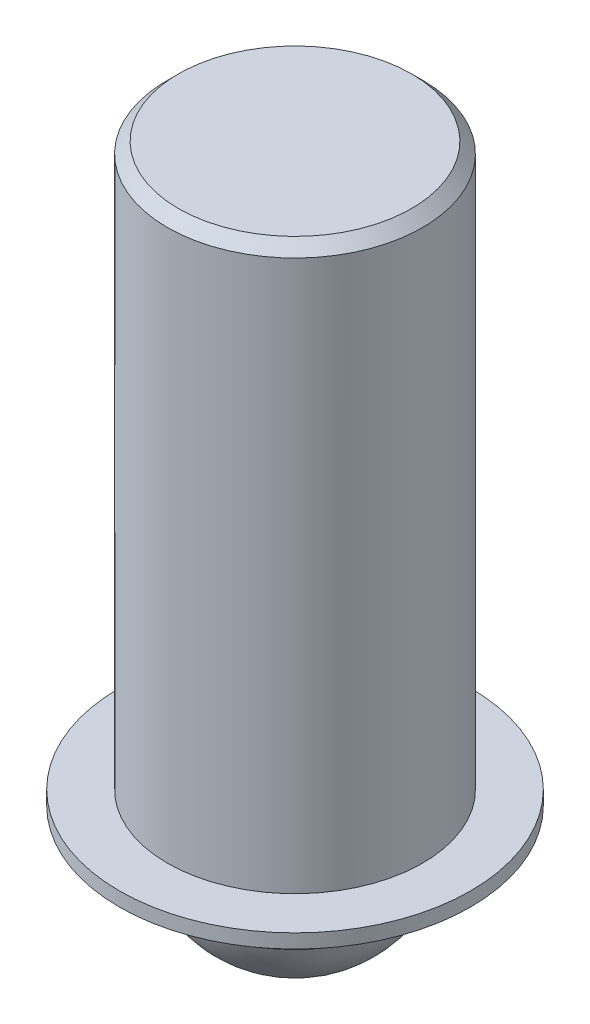
ISO-10303-21;
HEADER;
FILE_DESCRIPTION(('STEP AP214'),'2;1');
FILE_NAME('part.step','',(''),(''),'','','');
FILE_SCHEMA(('AUTOMOTIVE_DESIGN { 1 0 10303 214 1 1 1 1 }'));
ENDSEC;
DATA;
#1=APPLICATION_CONTEXT('core data for automotive mechanical design processes');
#2=APPLICATION_PROTOCOL_DEFINITION('international standard','automotive_design',2000,#1);
#3=PRODUCT_CONTEXT('',#1,'mechanical');
#4=PRODUCT('Part','Part','',(#3));
#5=PRODUCT_RELATED_PRODUCT_CATEGORY('part','',(#4));
#6=PRODUCT_DEFINITION_FORMATION('','',#4);
#7=PRODUCT_DEFINITION_CONTEXT('part definition',#1,'design');
#8=PRODUCT_DEFINITION('design','',#6,#7);
#9=PRODUCT_DEFINITION_SHAPE('','',#8);
#10=(LENGTH_UNIT() NAMED_UNIT(*) SI_UNIT(.MILLI.,.METRE.));
#11=(NAMED_UNIT(*) PLANE_ANGLE_UNIT() SI_UNIT($,.RADIAN.));
#12=(NAMED_UNIT(*) SI_UNIT($,.STERADIAN.) SOLID_ANGLE_UNIT());
#13=UNCERTAINTY_MEASURE_WITH_UNIT(LENGTH_MEASURE(1.E-05),#10,'distance_accuracy_value','');
#14=(GEOMETRIC_REPRESENTATION_CONTEXT(3) GLOBAL_UNCERTAINTY_ASSIGNED_CONTEXT((#13)) GLOBAL_UNIT_ASSIGNED_CONTEXT((#10,
#11,#12)) REPRESENTATION_CONTEXT('',''));
#15=CARTESIAN_POINT('',(0.,0.,0.));
#16=DIRECTION('',(0.,0.,1.));
#17=DIRECTION('',(1.,0.,0.));
#18=AXIS2_PLACEMENT_3D('',#15,#16,#17);
#19=CARTESIAN_POINT('',(0.,-11.8618,0.));
#20=DIRECTION('',(0.,0.,1.));
#21=DIRECTION('',(0.,1.,0.));
#22=AXIS2_PLACEMENT_3D('',#19,#20,#21);
#23=SPHERICAL_SURFACE('',#22,5.5499);
#24=CARTESIAN_POINT('',(0.,-11.8618,-5.5499));
#25=VERTEX_POINT('',#24);
#26=VERTEX_LOOP('',#25);
#27=FACE_BOUND('',#26,.T.);
#28=CARTESIAN_POINT('',(0.,-11.8618,5.5499));
#29=VERTEX_POINT('',#28);
#30=VERTEX_LOOP('',#29);
#31=FACE_BOUND('',#30,.T.);
#32=ADVANCED_FACE('P0_F15',(#27,#31),#23,.T.);
#33=CLOSED_SHELL('',(#32));
#34=MANIFOLD_SOLID_BREP('P0_B1',#33);
#35=CARTESIAN_POINT('',(0.,-10.5283,5.5499));
#36=DIRECTION('',(0.,-1.,0.));
#37=DIRECTION('',(0.,0.,-1.));
#38=AXIS2_PLACEMENT_3D('',#35,#36,#37);
#39=PLANE('',#38);
#40=CARTESIAN_POINT('',(0.,-10.5283,0.));
#41=DIRECTION('',(0.,1.,0.));
#42=DIRECTION('',(0.,0.,1.));
#43=AXIS2_PLACEMENT_3D('',#40,#41,#42);
#44=CIRCLE('',#43,5.5499);
#45=CARTESIAN_POINT('',(0.,-10.5283,5.5499));
#46=VERTEX_POINT('',#45);
#47=EDGE_CURVE('P1_E17',#46,#46,#44,.F.);
#48=ORIENTED_EDGE('',*,*,#47,.T.);
#49=EDGE_LOOP('',(#48));
#50=FACE_BOUND('',#49,.T.);
#51=ADVANCED_FACE('P1_F14',(#50),#39,.T.);
#52=CARTESIAN_POINT('',(0.,17.4117,0.));
#53=DIRECTION('',(0.,1.,0.));
#54=DIRECTION('',(0.,0.,1.));
#55=AXIS2_PLACEMENT_3D('',#52,#53,#54);
#56=CYLINDRICAL_SURFACE('',#55,5.5499);
#57=ORIENTED_EDGE('',*,*,#47,.F.);
#58=EDGE_LOOP('',(#57));
#59=FACE_BOUND('',#58,.T.);
#60=CARTESIAN_POINT('',(0.,-13.3223,0.));
#61=DIRECTION('',(0.,1.,0.));
#62=DIRECTION('',(0.,0.,1.));
#63=AXIS2_PLACEMENT_3D('',#60,#61,#62);
#64=CIRCLE('',#63,5.5499);
#65=CARTESIAN_POINT('',(0.,-13.3223,5.5499));
#66=VERTEX_POINT('',#65);
#67=EDGE_CURVE('P1_E40',#66,#66,#64,.T.);
#68=ORIENTED_EDGE('',*,*,#67,.F.);
#69=EDGE_LOOP('',(#68));
#70=FACE_BOUND('',#69,.T.);
#71=ADVANCED_FACE('P1_F48',(#59,#70),#56,.F.);
#72=CARTESIAN_POINT('',(0.,-13.3223,5.8039));
#73=DIRECTION('',(0.,-1.,0.));
#74=DIRECTION('',(0.,0.,-1.));
#75=AXIS2_PLACEMENT_3D('',#72,#73,#74);
#76=PLANE('',#75);
#77=ORIENTED_EDGE('',*,*,#67,.T.);
#78=EDGE_LOOP('',(#77));
#79=FACE_BOUND('',#78,.T.);
#80=CARTESIAN_POINT('',(0.,-13.3223,0.));
#81=DIRECTION('',(0.,1.,0.));
#82=DIRECTION('',(0.,0.,1.));
#83=AXIS2_PLACEMENT_3D('',#80,#81,#82);
#84=CIRCLE('',#83,5.8039);
#85=CARTESIAN_POINT('',(0.,-13.3223,5.8039));
#86=VERTEX_POINT('',#85);
#87=EDGE_CURVE('P1_E38',#86,#86,#84,.T.);
#88=ORIENTED_EDGE('',*,*,#87,.F.);
#89=EDGE_LOOP('',(#88));
#90=FACE_BOUND('',#89,.T.);
#91=ADVANCED_FACE('P1_F51',(#79,#90),#76,.T.);
#92=CARTESIAN_POINT('',(0.,-11.2268,0.));
#93=DIRECTION('',(0.,1.,0.));
#94=DIRECTION('',(0.,0.,1.));
#95=AXIS2_PLACEMENT_3D('',#92,#93,#94);
#96=CONICAL_SURFACE('',#95,8.7376,0.950546840812076);
#97=ORIENTED_EDGE('',*,*,#87,.T.);
#98=EDGE_LOOP('',(#97));
#99=FACE_BOUND('',#98,.T.);
#100=CARTESIAN_POINT('',(0.,-11.2268,0.));
#101=DIRECTION('',(0.,1.,0.));
#102=DIRECTION('',(0.,0.,1.));
#103=AXIS2_PLACEMENT_3D('',#100,#101,#102);
#104=CIRCLE('',#103,8.7376);
#105=CARTESIAN_POINT('',(0.,-11.2268,8.7376));
#106=VERTEX_POINT('',#105);
#107=EDGE_CURVE('P1_E37',#106,#106,#104,.T.);
#108=ORIENTED_EDGE('',*,*,#107,.F.);
#109=EDGE_LOOP('',(#108));
#110=FACE_BOUND('',#109,.T.);
#111=ADVANCED_FACE('P1_F57',(#99,#110),#96,.T.);
#112=CARTESIAN_POINT('',(0.,17.4117,5.8039));
#113=DIRECTION('',(0.,1.,0.));
#114=DIRECTION('',(0.,0.,1.));
#115=AXIS2_PLACEMENT_3D('',#112,#113,#114);
#116=PLANE('',#115);
#117=CARTESIAN_POINT('',(0.,17.4117000000251,0.));
#118=DIRECTION('',(0.,-1.,0.));
#119=DIRECTION('',(0.,0.,-1.));
#120=AXIS2_PLACEMENT_3D('',#117,#118,#119);
#121=CIRCLE('',#120,5.80390000004627);
#122=CARTESIAN_POINT('',(0.,17.4117000000251,-5.80390000004627));
#123=VERTEX_POINT('',#122);
#124=EDGE_CURVE('P1_E34',#123,#123,#121,.T.);
#125=ORIENTED_EDGE('',*,*,#124,.F.);
#126=EDGE_LOOP('',(#125));
#127=FACE_BOUND('',#126,.T.);
#128=ADVANCED_FACE('P1_F77',(#127),#116,.T.);
#129=CARTESIAN_POINT('',(0.,17.4117,0.));
#130=DIRECTION('',(0.,1.,0.));
#131=DIRECTION('',(0.,0.,1.));
#132=AXIS2_PLACEMENT_3D('',#129,#130,#131);
#133=CYLINDRICAL_SURFACE('',#132,8.7376);
#134=ORIENTED_EDGE('',*,*,#107,.T.);
#135=EDGE_LOOP('',(#134));
#136=FACE_BOUND('',#135,.T.);
#137=CARTESIAN_POINT('',(0.,-10.5283,0.));
#138=DIRECTION('',(0.,1.,0.));
#139=DIRECTION('',(0.,0.,1.));
#140=AXIS2_PLACEMENT_3D('',#137,#138,#139);
#141=CIRCLE('',#140,8.7376);
#142=CARTESIAN_POINT('',(0.,-10.5283,8.7376));
#143=VERTEX_POINT('',#142);
#144=EDGE_CURVE('P1_E26',#143,#143,#141,.T.);
#145=ORIENTED_EDGE('',*,*,#144,.F.);
#146=EDGE_LOOP('',(#145));
#147=FACE_BOUND('',#146,.T.);
#148=ADVANCED_FACE('P1_F73',(#136,#147),#133,.T.);
#149=CARTESIAN_POINT('',(0.,16.8656000000738,0.));
#150=DIRECTION('',(0.,-1.,0.));
#151=DIRECTION('',(0.,0.,-1.));
#152=AXIS2_PLACEMENT_3D('',#149,#150,#151);
#153=CONICAL_SURFACE('',#152,6.34999999999763,0.785398163397448);
#154=ORIENTED_EDGE('',*,*,#124,.T.);
#155=EDGE_LOOP('',(#154));
#156=FACE_BOUND('',#155,.T.);
#157=CARTESIAN_POINT('',(0.,16.8656,0.));
#158=DIRECTION('',(0.,1.,0.));
#159=DIRECTION('',(0.,0.,1.));
#160=AXIS2_PLACEMENT_3D('',#157,#158,#159);
#161=CIRCLE('',#160,6.35);
#162=CARTESIAN_POINT('',(0.,16.8656,6.35));
#163=VERTEX_POINT('',#162);
#164=EDGE_CURVE('P1_E21',#163,#163,#161,.F.);
#165=ORIENTED_EDGE('',*,*,#164,.F.);
#166=EDGE_LOOP('',(#165));
#167=FACE_BOUND('',#166,.T.);
#168=ADVANCED_FACE('P1_F66',(#156,#167),#153,.T.);
#169=CARTESIAN_POINT('',(0.,-10.5283,8.7376));
#170=DIRECTION('',(0.,1.,0.));
#171=DIRECTION('',(0.,0.,1.));
#172=AXIS2_PLACEMENT_3D('',#169,#170,#171);
#173=PLANE('',#172);
#174=CARTESIAN_POINT('',(0.,-10.5283,0.));
#175=DIRECTION('',(0.,1.,0.));
#176=DIRECTION('',(0.,0.,1.));
#177=AXIS2_PLACEMENT_3D('',#174,#175,#176);
#178=CIRCLE('',#177,6.35);
#179=CARTESIAN_POINT('',(0.,-10.5283,6.35));
#180=VERTEX_POINT('',#179);
#181=EDGE_CURVE('P1_E10',#180,#180,#178,.T.);
#182=ORIENTED_EDGE('',*,*,#181,.F.);
#183=EDGE_LOOP('',(#182));
#184=FACE_BOUND('',#183,.T.);
#185=ORIENTED_EDGE('',*,*,#144,.T.);
#186=EDGE_LOOP('',(#185));
#187=FACE_BOUND('',#186,.T.);
#188=ADVANCED_FACE('P1_F61',(#184,#187),#173,.T.);
#189=CARTESIAN_POINT('',(0.,17.4117,0.));
#190=DIRECTION('',(0.,1.,0.));
#191=DIRECTION('',(0.,0.,1.));
#192=AXIS2_PLACEMENT_3D('',#189,#190,#191);
#193=CYLINDRICAL_SURFACE('',#192,6.35);
#194=ORIENTED_EDGE('',*,*,#181,.T.);
#195=EDGE_LOOP('',(#194));
#196=FACE_BOUND('',#195,.T.);
#197=ORIENTED_EDGE('',*,*,#164,.T.);
#198=EDGE_LOOP('',(#197));
#199=FACE_BOUND('',#198,.T.);
#200=ADVANCED_FACE('P1_F59',(#196,#199),#193,.T.);
#201=CLOSED_SHELL('',(#51,#71,#91,#111,#128,#148,#168,#188,#200));
#202=MANIFOLD_SOLID_BREP('P1_B1',#201);
#203=ADVANCED_BREP_SHAPE_REPRESENTATION('',(#18,#34,#202),#14);
#204=SHAPE_DEFINITION_REPRESENTATION(#9,#203);
ENDSEC;
END-ISO-10303-21;
